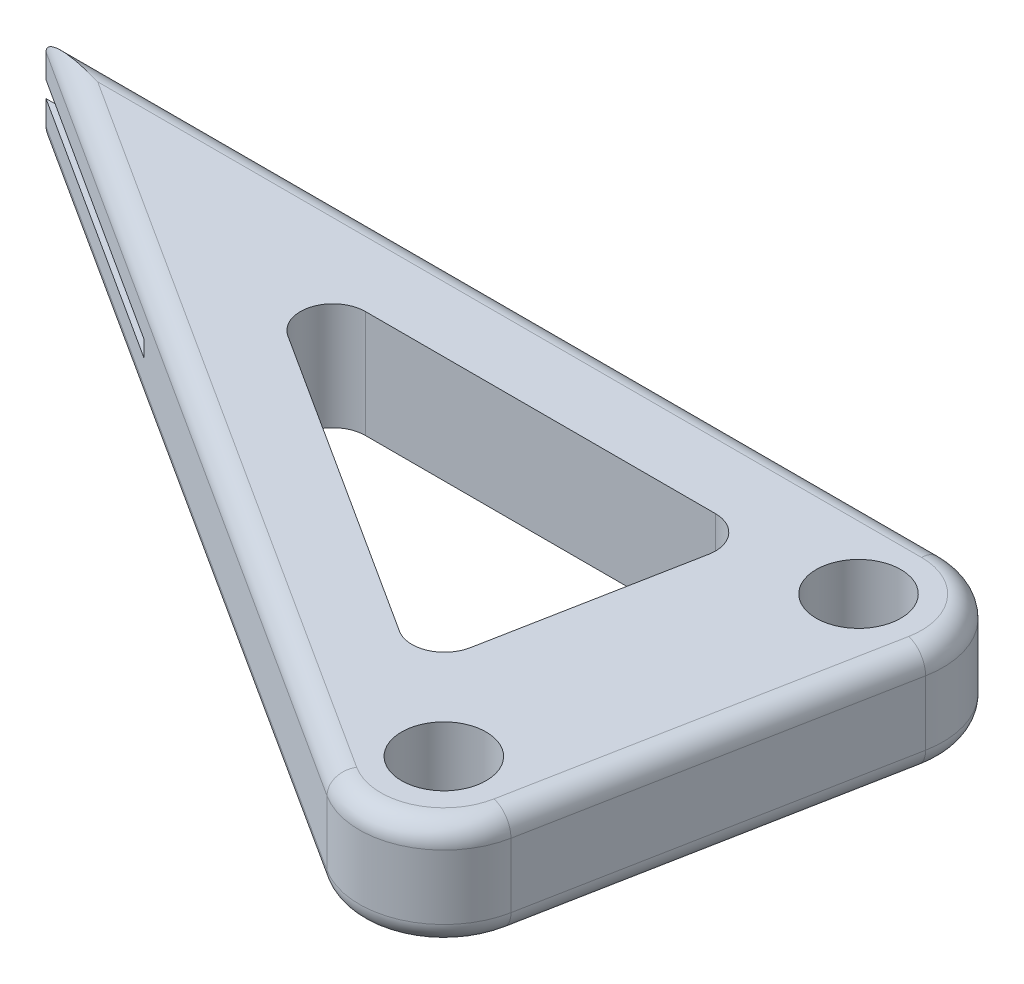
ISO-10303-21;
HEADER;
FILE_DESCRIPTION(('STEP AP214'),'2;1');
FILE_NAME('part.step','',(''),(''),'','','');
FILE_SCHEMA(('AUTOMOTIVE_DESIGN { 1 0 10303 214 1 1 1 1 }'));
ENDSEC;
DATA;
#1=APPLICATION_CONTEXT('core data for automotive mechanical design processes');
#2=APPLICATION_PROTOCOL_DEFINITION('international standard','automotive_design',2000,#1);
#3=PRODUCT_CONTEXT('',#1,'mechanical');
#4=PRODUCT('Part','Part','',(#3));
#5=PRODUCT_RELATED_PRODUCT_CATEGORY('part','',(#4));
#6=PRODUCT_DEFINITION_FORMATION('','',#4);
#7=PRODUCT_DEFINITION_CONTEXT('part definition',#1,'design');
#8=PRODUCT_DEFINITION('design','',#6,#7);
#9=PRODUCT_DEFINITION_SHAPE('','',#8);
#10=(LENGTH_UNIT() NAMED_UNIT(*) SI_UNIT(.MILLI.,.METRE.));
#11=(NAMED_UNIT(*) PLANE_ANGLE_UNIT() SI_UNIT($,.RADIAN.));
#12=(NAMED_UNIT(*) SI_UNIT($,.STERADIAN.) SOLID_ANGLE_UNIT());
#13=UNCERTAINTY_MEASURE_WITH_UNIT(LENGTH_MEASURE(1.E-05),#10,'distance_accuracy_value','');
#14=(GEOMETRIC_REPRESENTATION_CONTEXT(3) GLOBAL_UNCERTAINTY_ASSIGNED_CONTEXT((#13)) GLOBAL_UNIT_ASSIGNED_CONTEXT((#10,
#11,#12)) REPRESENTATION_CONTEXT('',''));
#15=CARTESIAN_POINT('',(0.,0.,0.));
#16=DIRECTION('',(0.,0.,1.));
#17=DIRECTION('',(1.,0.,0.));
#18=AXIS2_PLACEMENT_3D('',#15,#16,#17);
#19=CARTESIAN_POINT('',(-16.5593695843833,10.5409945852272,31.1982349996537));
#20=DIRECTION('',(0.,1.,0.));
#21=DIRECTION('',(0.,0.,1.));
#22=AXIS2_PLACEMENT_3D('',#19,#20,#21);
#23=PLANE('',#22);
#24=DIRECTION('',(-1.,0.,0.));
#25=VECTOR('',#24,1.);
#26=CARTESIAN_POINT('',(-19.3042202787324,10.5409945852272,4.18775475768354));
#27=LINE('',#26,#25);
#28=CARTESIAN_POINT('',(-22.3768257527279,10.5409945852272,4.18775475768354));
#29=VERTEX_POINT('',#28);
#30=CARTESIAN_POINT('',(-49.6901354335618,10.5409945852272,4.18775475768354));
#31=VERTEX_POINT('',#30);
#32=EDGE_CURVE('E236',#29,#31,#27,.T.);
#33=ORIENTED_EDGE('',*,*,#32,.F.);
#34=CARTESIAN_POINT('',(-22.3768257527279,10.5409945852272,6.72775475768354));
#35=DIRECTION('',(0.,1.,0.));
#36=DIRECTION('',(0.,0.,1.));
#37=AXIS2_PLACEMENT_3D('',#34,#35,#36);
#38=CIRCLE('',#37,2.54);
#39=CARTESIAN_POINT('',(-19.8821627369363,10.5409945852272,7.20551666244545));
#40=VERTEX_POINT('',#39);
#41=EDGE_CURVE('E358',#29,#40,#38,.F.);
#42=ORIENTED_EDGE('',*,*,#41,.T.);
#43=DIRECTION('',(0.188095238095238,0.,-0.982150793618727));
#44=VECTOR('',#43,1.);
#45=CARTESIAN_POINT('',(-23.5786182474099,10.5409945852272,26.506785264204));
#46=LINE('',#45,#44);
#47=CARTESIAN_POINT('',(-22.8722441318273,10.5409945852272,22.8184096028283));
#48=VERTEX_POINT('',#47);
#49=EDGE_CURVE('E229',#48,#40,#46,.T.);
#50=ORIENTED_EDGE('',*,*,#49,.F.);
#51=CARTESIAN_POINT('',(-25.3669071476189,10.5409945852272,22.3406476980664));
#52=DIRECTION('',(0.,1.,0.));
#53=DIRECTION('',(0.,0.,1.));
#54=AXIS2_PLACEMENT_3D('',#51,#52,#53);
#55=CIRCLE('',#54,2.54);
#56=CARTESIAN_POINT('',(-26.7389718063042,10.5409945852272,24.4781786504474));
#57=VERTEX_POINT('',#56);
#58=EDGE_CURVE('E354',#48,#57,#55,.F.);
#59=ORIENTED_EDGE('',*,*,#58,.T.);
#60=DIRECTION('',(0.841547619047619,0.,0.5401829364903));
#61=VECTOR('',#60,1.);
#62=CARTESIAN_POINT('',(-58.3492963148218,10.5409945852272,4.18775475768354));
#63=LINE('',#62,#61);
#64=CARTESIAN_POINT('',(-51.0622000922472,10.5409945852272,8.86528571006449));
#65=VERTEX_POINT('',#64);
#66=EDGE_CURVE('E238',#65,#57,#63,.T.);
#67=ORIENTED_EDGE('',*,*,#66,.F.);
#68=CARTESIAN_POINT('',(-49.6901354335618,10.5409945852272,6.72775475768354));
#69=DIRECTION('',(0.,1.,0.));
#70=DIRECTION('',(0.,0.,1.));
#71=AXIS2_PLACEMENT_3D('',#68,#69,#70);
#72=CIRCLE('',#71,2.54);
#73=EDGE_CURVE('E362',#65,#31,#72,.F.);
#74=ORIENTED_EDGE('',*,*,#73,.T.);
#75=EDGE_LOOP('',(#33,#42,#50,#59,#67,#74));
#76=FACE_BOUND('',#75,.T.);
#77=CARTESIAN_POINT('',(-11.3565424415261,10.5409945852272,4.03135475768354));
#78=DIRECTION('',(0.,1.,0.));
#79=DIRECTION('',(0.,0.,1.));
#80=AXIS2_PLACEMENT_3D('',#77,#78,#79);
#81=CIRCLE('',#80,4.9236);
#82=CARTESIAN_POINT('',(-6.52082479406497,10.5409945852272,4.95746047196925));
#83=VERTEX_POINT('',#82);
#84=CARTESIAN_POINT('',(-11.3565424415261,10.5409945852272,-0.892245242316461));
#85=VERTEX_POINT('',#84);
#86=EDGE_CURVE('E306',#83,#85,#81,.T.);
#87=ORIENTED_EDGE('',*,*,#86,.T.);
#88=DIRECTION('',(-1.,0.,0.));
#89=VECTOR('',#88,1.);
#90=CARTESIAN_POINT('',(-81.3826642589733,10.5409945852272,-0.892245242316454));
#91=LINE('',#90,#89);
#92=CARTESIAN_POINT('',(-75.6676180773418,10.5409945852272,-0.892245242316454));
#93=VERTEX_POINT('',#92);
#94=EDGE_CURVE('E308',#85,#93,#91,.T.);
#95=ORIENTED_EDGE('',*,*,#94,.T.);
#96=DIRECTION('',(0.841547619047619,0.,0.5401829364903));
#97=VECTOR('',#96,1.);
#98=CARTESIAN_POINT('',(-19.2190142904869,10.5409945852272,35.3416788567966));
#99=LINE('',#98,#97);
#100=CARTESIAN_POINT('',(-19.2190142904869,10.5409945852272,35.3416788567966));
#101=VERTEX_POINT('',#100);
#102=EDGE_CURVE('E300',#93,#101,#99,.T.);
#103=ORIENTED_EDGE('',*,*,#102,.T.);
#104=CARTESIAN_POINT('',(-16.5593695843833,10.5409945852272,31.1982349996537));
#105=DIRECTION('',(0.,1.,0.));
#106=DIRECTION('',(0.,0.,1.));
#107=AXIS2_PLACEMENT_3D('',#104,#105,#106);
#108=CIRCLE('',#107,4.9236);
#109=CARTESIAN_POINT('',(-11.7236519369221,10.5409945852272,32.1243407139394));
#110=VERTEX_POINT('',#109);
#111=EDGE_CURVE('E302',#101,#110,#108,.T.);
#112=ORIENTED_EDGE('',*,*,#111,.T.);
#113=DIRECTION('',(0.188095238095238,0.,-0.982150793618727));
#114=VECTOR('',#113,1.);
#115=CARTESIAN_POINT('',(-6.52082479406497,10.5409945852272,4.95746047196924));
#116=LINE('',#115,#114);
#117=EDGE_CURVE('E304',#110,#83,#116,.T.);
#118=ORIENTED_EDGE('',*,*,#117,.T.);
#119=EDGE_LOOP('',(#87,#95,#103,#112,#118));
#120=FACE_BOUND('',#119,.T.);
#121=CARTESIAN_POINT('',(-11.3565424415261,10.5409945852272,4.03135475768354));
#122=DIRECTION('',(0.,1.,0.));
#123=DIRECTION('',(0.,0.,1.));
#124=AXIS2_PLACEMENT_3D('',#121,#122,#123);
#125=CIRCLE('',#124,3.3);
#126=CARTESIAN_POINT('',(-11.3565424415261,10.5409945852272,7.33135475768354));
#127=VERTEX_POINT('',#126);
#128=EDGE_CURVE('E252',#127,#127,#125,.T.);
#129=ORIENTED_EDGE('',*,*,#128,.F.);
#130=EDGE_LOOP('',(#129));
#131=FACE_BOUND('',#130,.T.);
#132=CARTESIAN_POINT('',(-16.5593695843833,10.5409945852272,31.1982349996537));
#133=DIRECTION('',(0.,1.,0.));
#134=DIRECTION('',(0.,0.,1.));
#135=AXIS2_PLACEMENT_3D('',#132,#133,#134);
#136=CIRCLE('',#135,3.3);
#137=CARTESIAN_POINT('',(-16.5593695843833,10.5409945852272,34.4982349996537));
#138=VERTEX_POINT('',#137);
#139=EDGE_CURVE('E244',#138,#138,#136,.T.);
#140=ORIENTED_EDGE('',*,*,#139,.F.);
#141=EDGE_LOOP('',(#140));
#142=FACE_BOUND('',#141,.T.);
#143=ADVANCED_FACE('F34',(#76,#120,#131,#142),#23,.T.);
#144=CARTESIAN_POINT('',(-16.5593695843833,2.15899458522718,31.1982349996537));
#145=DIRECTION('',(0.,1.,0.));
#146=DIRECTION('',(0.,0.,1.));
#147=AXIS2_PLACEMENT_3D('',#144,#145,#146);
#148=PLANE('',#147);
#149=DIRECTION('',(0.841547619047619,0.,0.5401829364903));
#150=VECTOR('',#149,1.);
#151=CARTESIAN_POINT('',(-58.3492963148218,2.15899458522718,4.18775475768354));
#152=LINE('',#151,#150);
#153=CARTESIAN_POINT('',(-51.0622000922472,2.15899458522718,8.86528571006449));
#154=VERTEX_POINT('',#153);
#155=CARTESIAN_POINT('',(-26.7389718063042,2.15899458522718,24.4781786504474));
#156=VERTEX_POINT('',#155);
#157=EDGE_CURVE('E228',#154,#156,#152,.T.);
#158=ORIENTED_EDGE('',*,*,#157,.T.);
#159=CARTESIAN_POINT('',(-25.3669071476189,2.15899458522718,22.3406476980664));
#160=DIRECTION('',(0.,1.,0.));
#161=DIRECTION('',(0.,0.,1.));
#162=AXIS2_PLACEMENT_3D('',#159,#160,#161);
#163=CIRCLE('',#162,2.54);
#164=CARTESIAN_POINT('',(-22.8722441318273,2.15899458522718,22.8184096028283));
#165=VERTEX_POINT('',#164);
#166=EDGE_CURVE('E356',#156,#165,#163,.T.);
#167=ORIENTED_EDGE('',*,*,#166,.T.);
#168=DIRECTION('',(0.188095238095238,0.,-0.982150793618727));
#169=VECTOR('',#168,1.);
#170=CARTESIAN_POINT('',(-23.5786182474099,2.15899458522718,26.506785264204));
#171=LINE('',#170,#169);
#172=CARTESIAN_POINT('',(-19.8821627369363,2.15899458522718,7.20551666244545));
#173=VERTEX_POINT('',#172);
#174=EDGE_CURVE('E232',#165,#173,#171,.T.);
#175=ORIENTED_EDGE('',*,*,#174,.T.);
#176=CARTESIAN_POINT('',(-22.3768257527279,2.15899458522718,6.72775475768354));
#177=DIRECTION('',(0.,1.,0.));
#178=DIRECTION('',(0.,0.,1.));
#179=AXIS2_PLACEMENT_3D('',#176,#177,#178);
#180=CIRCLE('',#179,2.54);
#181=CARTESIAN_POINT('',(-22.3768257527279,2.15899458522718,4.18775475768354));
#182=VERTEX_POINT('',#181);
#183=EDGE_CURVE('E360',#173,#182,#180,.T.);
#184=ORIENTED_EDGE('',*,*,#183,.T.);
#185=DIRECTION('',(-1.,0.,0.));
#186=VECTOR('',#185,1.);
#187=CARTESIAN_POINT('',(-19.3042202787324,2.15899458522718,4.18775475768354));
#188=LINE('',#187,#186);
#189=CARTESIAN_POINT('',(-49.6901354335618,2.15899458522718,4.18775475768354));
#190=VERTEX_POINT('',#189);
#191=EDGE_CURVE('E226',#182,#190,#188,.T.);
#192=ORIENTED_EDGE('',*,*,#191,.T.);
#193=CARTESIAN_POINT('',(-49.6901354335618,2.15899458522718,6.72775475768354));
#194=DIRECTION('',(0.,1.,0.));
#195=DIRECTION('',(0.,0.,1.));
#196=AXIS2_PLACEMENT_3D('',#193,#194,#195);
#197=CIRCLE('',#196,2.54);
#198=EDGE_CURVE('E364',#190,#154,#197,.T.);
#199=ORIENTED_EDGE('',*,*,#198,.T.);
#200=EDGE_LOOP('',(#158,#167,#175,#184,#192,#199));
#201=FACE_BOUND('',#200,.T.);
#202=DIRECTION('',(0.841547619047619,0.,0.5401829364903));
#203=VECTOR('',#202,1.);
#204=CARTESIAN_POINT('',(-19.2190142904869,2.15899458522718,35.3416788567966));
#205=LINE('',#204,#203);
#206=CARTESIAN_POINT('',(-19.2190142904869,2.15899458522718,35.3416788567966));
#207=VERTEX_POINT('',#206);
#208=CARTESIAN_POINT('',(-75.6676180773418,2.15899458522718,-0.892245242316458));
#209=VERTEX_POINT('',#208);
#210=EDGE_CURVE('E277',#207,#209,#205,.F.);
#211=ORIENTED_EDGE('',*,*,#210,.T.);
#212=DIRECTION('',(-1.,0.,0.));
#213=VECTOR('',#212,1.);
#214=CARTESIAN_POINT('',(-16.5593695843833,2.15899458522718,-0.892245242316462));
#215=LINE('',#214,#213);
#216=CARTESIAN_POINT('',(-11.3565424415261,2.15899458522718,-0.892245242316461));
#217=VERTEX_POINT('',#216);
#218=EDGE_CURVE('E285',#209,#217,#215,.F.);
#219=ORIENTED_EDGE('',*,*,#218,.T.);
#220=CARTESIAN_POINT('',(-11.3565424415261,2.15899458522718,4.03135475768354));
#221=DIRECTION('',(0.,1.,0.));
#222=DIRECTION('',(0.,0.,1.));
#223=AXIS2_PLACEMENT_3D('',#220,#221,#222);
#224=CIRCLE('',#223,4.9236);
#225=CARTESIAN_POINT('',(-6.52082479406497,2.15899458522718,4.95746047196925));
#226=VERTEX_POINT('',#225);
#227=EDGE_CURVE('E283',#217,#226,#224,.F.);
#228=ORIENTED_EDGE('',*,*,#227,.T.);
#229=DIRECTION('',(0.188095238095238,0.,-0.982150793618727));
#230=VECTOR('',#229,1.);
#231=CARTESIAN_POINT('',(-11.7236519369221,2.15899458522718,32.1243407139394));
#232=LINE('',#231,#230);
#233=CARTESIAN_POINT('',(-11.7236519369221,2.15899458522718,32.1243407139394));
#234=VERTEX_POINT('',#233);
#235=EDGE_CURVE('E281',#226,#234,#232,.F.);
#236=ORIENTED_EDGE('',*,*,#235,.T.);
#237=CARTESIAN_POINT('',(-16.5593695843833,2.15899458522718,31.1982349996537));
#238=DIRECTION('',(0.,1.,0.));
#239=DIRECTION('',(0.,0.,1.));
#240=AXIS2_PLACEMENT_3D('',#237,#238,#239);
#241=CIRCLE('',#240,4.9236);
#242=EDGE_CURVE('E279',#234,#207,#241,.F.);
#243=ORIENTED_EDGE('',*,*,#242,.T.);
#244=EDGE_LOOP('',(#211,#219,#228,#236,#243));
#245=FACE_BOUND('',#244,.T.);
#246=CARTESIAN_POINT('',(-11.3565424415261,2.15899458522718,4.03135475768354));
#247=DIRECTION('',(0.,1.,0.));
#248=DIRECTION('',(0.,0.,1.));
#249=AXIS2_PLACEMENT_3D('',#246,#247,#248);
#250=CIRCLE('',#249,3.3);
#251=CARTESIAN_POINT('',(-11.3565424415261,2.15899458522718,7.33135475768354));
#252=VERTEX_POINT('',#251);
#253=EDGE_CURVE('E247',#252,#252,#250,.T.);
#254=ORIENTED_EDGE('',*,*,#253,.T.);
#255=EDGE_LOOP('',(#254));
#256=FACE_BOUND('',#255,.T.);
#257=CARTESIAN_POINT('',(-16.5593695843833,2.15899458522718,31.1982349996537));
#258=DIRECTION('',(0.,1.,0.));
#259=DIRECTION('',(0.,0.,1.));
#260=AXIS2_PLACEMENT_3D('',#257,#258,#259);
#261=CIRCLE('',#260,3.3);
#262=CARTESIAN_POINT('',(-16.5593695843833,2.15899458522718,34.4982349996537));
#263=VERTEX_POINT('',#262);
#264=EDGE_CURVE('E248',#263,#263,#261,.T.);
#265=ORIENTED_EDGE('',*,*,#264,.T.);
#266=EDGE_LOOP('',(#265));
#267=FACE_BOUND('',#266,.T.);
#268=ADVANCED_FACE('F433',(#201,#245,#256,#267),#148,.F.);
#269=CARTESIAN_POINT('',(-62.4476898223621,10.5409945852272,9.58556904339783));
#270=DIRECTION('',(0.5401829364903,0.,-0.841547619047619));
#271=DIRECTION('',(-0.841547619047619,0.,-0.5401829364903));
#272=AXIS2_PLACEMENT_3D('',#269,#270,#271);
#273=PLANE('',#272);
#274=DIRECTION('',(0.,1.,0.));
#275=VECTOR('',#274,1.);
#276=CARTESIAN_POINT('',(-60.0073547351639,6.98499458522718,11.1520013445372));
#277=LINE('',#276,#275);
#278=CARTESIAN_POINT('',(-60.0073547351639,5.71499458522717,11.1520013445372));
#279=VERTEX_POINT('',#278);
#280=CARTESIAN_POINT('',(-60.0073547351639,6.98499458522718,11.1520013445372));
#281=VERTEX_POINT('',#280);
#282=EDGE_CURVE('E204',#279,#281,#277,.T.);
#283=ORIENTED_EDGE('',*,*,#282,.F.);
#284=DIRECTION('',(-0.841547619047619,0.,-0.5401829364903));
#285=VECTOR('',#284,1.);
#286=CARTESIAN_POINT('',(-60.0073547351639,5.71499458522717,11.1520013445372));
#287=LINE('',#286,#285);
#288=CARTESIAN_POINT('',(-81.3826642589734,5.71499458522717,-2.56864524231647));
#289=VERTEX_POINT('',#288);
#290=EDGE_CURVE('E239',#279,#289,#287,.T.);
#291=ORIENTED_EDGE('',*,*,#290,.T.);
#292=DIRECTION('',(0.,-1.,0.));
#293=VECTOR('',#292,1.);
#294=CARTESIAN_POINT('',(-81.3826642589733,10.5409945852272,-2.56864524231646));
#295=LINE('',#294,#293);
#296=CARTESIAN_POINT('',(-81.3826642589733,3.83539458522718,-2.56864524231646));
#297=VERTEX_POINT('',#296);
#298=EDGE_CURVE('E255',#289,#297,#295,.T.);
#299=ORIENTED_EDGE('',*,*,#298,.T.);
#300=DIRECTION('',(0.841547619047619,0.,0.5401829364903));
#301=VECTOR('',#300,1.);
#302=CARTESIAN_POINT('',(-62.4476898223621,3.83539458522718,9.58556904339783));
#303=LINE('',#302,#301);
#304=CARTESIAN_POINT('',(-20.1245769652193,3.83539458522718,36.752449285368));
#305=VERTEX_POINT('',#304);
#306=EDGE_CURVE('E313',#297,#305,#303,.T.);
#307=ORIENTED_EDGE('',*,*,#306,.T.);
#308=DIRECTION('',(0.,-1.,0.));
#309=VECTOR('',#308,1.);
#310=CARTESIAN_POINT('',(-20.1245769652193,10.5409945852272,36.752449285368));
#311=LINE('',#310,#309);
#312=CARTESIAN_POINT('',(-20.1245769652193,8.86459458522718,36.752449285368));
#313=VERTEX_POINT('',#312);
#314=EDGE_CURVE('E268',#313,#305,#311,.T.);
#315=ORIENTED_EDGE('',*,*,#314,.F.);
#316=DIRECTION('',(0.841547619047619,0.,0.5401829364903));
#317=VECTOR('',#316,1.);
#318=CARTESIAN_POINT('',(-81.3826642589734,8.86459458522718,-2.56864524231646));
#319=LINE('',#318,#317);
#320=CARTESIAN_POINT('',(-81.3826642589733,8.86459458522718,-2.56864524231646));
#321=VERTEX_POINT('',#320);
#322=EDGE_CURVE('E311',#313,#321,#319,.F.);
#323=ORIENTED_EDGE('',*,*,#322,.T.);
#324=CARTESIAN_POINT('',(-81.3826642589733,6.98499458522718,-2.56864524231646));
#325=VERTEX_POINT('',#324);
#326=EDGE_CURVE('E218',#321,#325,#295,.T.);
#327=ORIENTED_EDGE('',*,*,#326,.T.);
#328=DIRECTION('',(-0.841547619047619,0.,-0.5401829364903));
#329=VECTOR('',#328,1.);
#330=CARTESIAN_POINT('',(-60.0073547351639,6.98499458522718,11.1520013445372));
#331=LINE('',#330,#329);
#332=EDGE_CURVE('E49',#281,#325,#331,.T.);
#333=ORIENTED_EDGE('',*,*,#332,.F.);
#334=EDGE_LOOP('',(#283,#291,#299,#307,#315,#323,#327,#333));
#335=FACE_BOUND('',#334,.T.);
#336=ADVANCED_FACE('F216',(#335),#273,.F.);
#337=CARTESIAN_POINT('',(-16.5593695843833,10.5409945852272,31.1982349996537));
#338=DIRECTION('',(0.,-1.,0.));
#339=DIRECTION('',(0.,0.,-1.));
#340=AXIS2_PLACEMENT_3D('',#337,#338,#339);
#341=CYLINDRICAL_SURFACE('',#340,6.6);
#342=ORIENTED_EDGE('',*,*,#314,.T.);
#343=CARTESIAN_POINT('',(-16.5593695843833,3.83539458522718,31.1982349996537));
#344=DIRECTION('',(0.,1.,0.));
#345=DIRECTION('',(0.,0.,1.));
#346=AXIS2_PLACEMENT_3D('',#343,#344,#345);
#347=CIRCLE('',#346,6.6);
#348=CARTESIAN_POINT('',(-10.0771743464997,3.83539458522718,32.4396635710823));
#349=VERTEX_POINT('',#348);
#350=EDGE_CURVE('E298',#305,#349,#347,.T.);
#351=ORIENTED_EDGE('',*,*,#350,.T.);
#352=DIRECTION('',(0.,-1.,0.));
#353=VECTOR('',#352,1.);
#354=CARTESIAN_POINT('',(-10.0771743464997,10.5409945852272,32.4396635710823));
#355=LINE('',#354,#353);
#356=CARTESIAN_POINT('',(-10.0771743464997,8.86459458522718,32.4396635710823));
#357=VERTEX_POINT('',#356);
#358=EDGE_CURVE('E265',#357,#349,#355,.T.);
#359=ORIENTED_EDGE('',*,*,#358,.F.);
#360=CARTESIAN_POINT('',(-16.5593695843833,8.86459458522718,31.1982349996537));
#361=DIRECTION('',(0.,1.,0.));
#362=DIRECTION('',(0.,0.,1.));
#363=AXIS2_PLACEMENT_3D('',#360,#361,#362);
#364=CIRCLE('',#363,6.6);
#365=EDGE_CURVE('E296',#357,#313,#364,.F.);
#366=ORIENTED_EDGE('',*,*,#365,.T.);
#367=EDGE_LOOP('',(#342,#351,#359,#366));
#368=FACE_BOUND('',#367,.T.);
#369=ADVANCED_FACE('F456',(#368),#341,.T.);
#370=CARTESIAN_POINT('',(-10.0771743464997,10.5409945852272,32.4396635710823));
#371=DIRECTION('',(-0.982150793618727,0.,-0.188095238095238));
#372=DIRECTION('',(-0.188095238095238,0.,0.982150793618727));
#373=AXIS2_PLACEMENT_3D('',#370,#371,#372);
#374=PLANE('',#373);
#375=ORIENTED_EDGE('',*,*,#358,.T.);
#376=DIRECTION('',(0.188095238095238,0.,-0.982150793618727));
#377=VECTOR('',#376,1.);
#378=CARTESIAN_POINT('',(-10.0771743464997,3.83539458522718,32.4396635710823));
#379=LINE('',#378,#377);
#380=CARTESIAN_POINT('',(-4.87434720364254,3.83539458522718,5.27278332911211));
#381=VERTEX_POINT('',#380);
#382=EDGE_CURVE('E294',#349,#381,#379,.T.);
#383=ORIENTED_EDGE('',*,*,#382,.T.);
#384=DIRECTION('',(0.,-1.,0.));
#385=VECTOR('',#384,1.);
#386=CARTESIAN_POINT('',(-4.87434720364254,10.5409945852272,5.27278332911211));
#387=LINE('',#386,#385);
#388=CARTESIAN_POINT('',(-4.87434720364254,8.86459458522718,5.27278332911211));
#389=VERTEX_POINT('',#388);
#390=EDGE_CURVE('E262',#389,#381,#387,.T.);
#391=ORIENTED_EDGE('',*,*,#390,.F.);
#392=DIRECTION('',(0.188095238095238,0.,-0.982150793618727));
#393=VECTOR('',#392,1.);
#394=CARTESIAN_POINT('',(-10.0771743464997,8.86459458522718,32.4396635710823));
#395=LINE('',#394,#393);
#396=EDGE_CURVE('E292',#389,#357,#395,.F.);
#397=ORIENTED_EDGE('',*,*,#396,.T.);
#398=EDGE_LOOP('',(#375,#383,#391,#397));
#399=FACE_BOUND('',#398,.T.);
#400=ADVANCED_FACE('F452',(#399),#374,.F.);
#401=CARTESIAN_POINT('',(-11.3565424415261,10.5409945852272,4.03135475768354));
#402=DIRECTION('',(0.,-1.,0.));
#403=DIRECTION('',(0.,0.,-1.));
#404=AXIS2_PLACEMENT_3D('',#401,#402,#403);
#405=CYLINDRICAL_SURFACE('',#404,6.6);
#406=ORIENTED_EDGE('',*,*,#390,.T.);
#407=CARTESIAN_POINT('',(-11.3565424415261,3.83539458522718,4.03135475768354));
#408=DIRECTION('',(0.,1.,0.));
#409=DIRECTION('',(0.,0.,1.));
#410=AXIS2_PLACEMENT_3D('',#407,#408,#409);
#411=CIRCLE('',#410,6.6);
#412=CARTESIAN_POINT('',(-11.3565424415261,3.83539458522718,-2.56864524231646));
#413=VERTEX_POINT('',#412);
#414=EDGE_CURVE('E290',#381,#413,#411,.T.);
#415=ORIENTED_EDGE('',*,*,#414,.T.);
#416=DIRECTION('',(0.,-1.,0.));
#417=VECTOR('',#416,1.);
#418=CARTESIAN_POINT('',(-11.3565424415261,10.5409945852272,-2.56864524231646));
#419=LINE('',#418,#417);
#420=CARTESIAN_POINT('',(-11.3565424415261,8.86459458522718,-2.56864524231646));
#421=VERTEX_POINT('',#420);
#422=EDGE_CURVE('E259',#421,#413,#419,.T.);
#423=ORIENTED_EDGE('',*,*,#422,.F.);
#424=CARTESIAN_POINT('',(-11.3565424415261,8.86459458522718,4.03135475768354));
#425=DIRECTION('',(0.,1.,0.));
#426=DIRECTION('',(0.,0.,1.));
#427=AXIS2_PLACEMENT_3D('',#424,#425,#426);
#428=CIRCLE('',#427,6.6);
#429=EDGE_CURVE('E288',#421,#389,#428,.F.);
#430=ORIENTED_EDGE('',*,*,#429,.T.);
#431=EDGE_LOOP('',(#406,#415,#423,#430));
#432=FACE_BOUND('',#431,.T.);
#433=ADVANCED_FACE('F449',(#432),#405,.T.);
#434=CARTESIAN_POINT('',(-58.8824824415261,10.5409945852272,-2.56864524231646));
#435=DIRECTION('',(0.,0.,1.));
#436=DIRECTION('',(1.,0.,0.));
#437=AXIS2_PLACEMENT_3D('',#434,#435,#436);
#438=PLANE('',#437);
#439=ORIENTED_EDGE('',*,*,#298,.F.);
#440=DIRECTION('',(1.,0.,0.));
#441=VECTOR('',#440,1.);
#442=CARTESIAN_POINT('',(-58.8824824415261,5.71499458522718,-2.56864524231646));
#443=LINE('',#442,#441);
#444=CARTESIAN_POINT('',(-77.8560811862513,5.71499458522717,-2.56864524231646));
#445=VERTEX_POINT('',#444);
#446=EDGE_CURVE('E11',#289,#445,#443,.T.);
#447=ORIENTED_EDGE('',*,*,#446,.T.);
#448=DIRECTION('',(0.,-1.,0.));
#449=VECTOR('',#448,1.);
#450=CARTESIAN_POINT('',(-77.8560811862513,10.5409945852272,-2.56864524231646));
#451=LINE('',#450,#449);
#452=CARTESIAN_POINT('',(-77.8560811862513,5.07999458522718,-2.56864524231646));
#453=VERTEX_POINT('',#452);
#454=EDGE_CURVE('E42',#445,#453,#451,.T.);
#455=ORIENTED_EDGE('',*,*,#454,.T.);
#456=DIRECTION('',(1.,0.,0.));
#457=VECTOR('',#456,1.);
#458=CARTESIAN_POINT('',(-58.8824824415261,5.07999458522717,-2.56864524231646));
#459=LINE('',#458,#457);
#460=CARTESIAN_POINT('',(-75.5050258044366,5.07999458522718,-2.56864524231646));
#461=VERTEX_POINT('',#460);
#462=EDGE_CURVE('E377',#453,#461,#459,.T.);
#463=ORIENTED_EDGE('',*,*,#462,.T.);
#464=DIRECTION('',(0.,1.,0.));
#465=VECTOR('',#464,1.);
#466=CARTESIAN_POINT('',(-75.5050258044366,10.5409945852272,-2.56864524231646));
#467=LINE('',#466,#465);
#468=CARTESIAN_POINT('',(-75.5050258044366,7.61999458522718,-2.56864524231646));
#469=VERTEX_POINT('',#468);
#470=EDGE_CURVE('E374',#461,#469,#467,.T.);
#471=ORIENTED_EDGE('',*,*,#470,.T.);
#472=DIRECTION('',(-1.,0.,0.));
#473=VECTOR('',#472,1.);
#474=CARTESIAN_POINT('',(-58.8824824415261,7.61999458522718,-2.56864524231646));
#475=LINE('',#474,#473);
#476=CARTESIAN_POINT('',(-77.8560811862513,7.61999458522718,-2.56864524231646));
#477=VERTEX_POINT('',#476);
#478=EDGE_CURVE('E371',#469,#477,#475,.T.);
#479=ORIENTED_EDGE('',*,*,#478,.T.);
#480=DIRECTION('',(0.,-1.,0.));
#481=VECTOR('',#480,1.);
#482=CARTESIAN_POINT('',(-77.8560811862513,10.5409945852272,-2.56864524231646));
#483=LINE('',#482,#481);
#484=CARTESIAN_POINT('',(-77.8560811862513,6.98499458522718,-2.56864524231646));
#485=VERTEX_POINT('',#484);
#486=EDGE_CURVE('E368',#477,#485,#483,.T.);
#487=ORIENTED_EDGE('',*,*,#486,.T.);
#488=DIRECTION('',(-1.,0.,0.));
#489=VECTOR('',#488,1.);
#490=CARTESIAN_POINT('',(-58.8824824415261,6.98499458522717,-2.56864524231646));
#491=LINE('',#490,#489);
#492=EDGE_CURVE('E366',#485,#325,#491,.T.);
#493=ORIENTED_EDGE('',*,*,#492,.T.);
#494=ORIENTED_EDGE('',*,*,#326,.F.);
#495=DIRECTION('',(-1.,0.,0.));
#496=VECTOR('',#495,1.);
#497=CARTESIAN_POINT('',(-11.3565424415261,8.86459458522718,-2.56864524231646));
#498=LINE('',#497,#496);
#499=EDGE_CURVE('E271',#321,#421,#498,.F.);
#500=ORIENTED_EDGE('',*,*,#499,.T.);
#501=ORIENTED_EDGE('',*,*,#422,.T.);
#502=DIRECTION('',(-1.,0.,0.));
#503=VECTOR('',#502,1.);
#504=CARTESIAN_POINT('',(-58.8824824415261,3.83539458522718,-2.56864524231646));
#505=LINE('',#504,#503);
#506=EDGE_CURVE('E274',#413,#297,#505,.T.);
#507=ORIENTED_EDGE('',*,*,#506,.T.);
#508=EDGE_LOOP('',(#439,#447,#455,#463,#471,#479,#487,#493,#494,#500,#501,#507));
#509=FACE_BOUND('',#508,.T.);
#510=ADVANCED_FACE('F382',(#509),#438,.F.);
#511=CARTESIAN_POINT('',(-11.3565424415261,10.5409945852272,4.03135475768354));
#512=DIRECTION('',(0.,-1.,0.));
#513=DIRECTION('',(0.,0.,-1.));
#514=AXIS2_PLACEMENT_3D('',#511,#512,#513);
#515=CYLINDRICAL_SURFACE('',#514,3.3);
#516=ORIENTED_EDGE('',*,*,#128,.T.);
#517=EDGE_LOOP('',(#516));
#518=FACE_BOUND('',#517,.T.);
#519=ORIENTED_EDGE('',*,*,#253,.F.);
#520=EDGE_LOOP('',(#519));
#521=FACE_BOUND('',#520,.T.);
#522=ADVANCED_FACE('F444',(#518,#521),#515,.F.);
#523=CARTESIAN_POINT('',(-16.5593695843833,10.5409945852272,31.1982349996537));
#524=DIRECTION('',(0.,-1.,0.));
#525=DIRECTION('',(0.,0.,-1.));
#526=AXIS2_PLACEMENT_3D('',#523,#524,#525);
#527=CYLINDRICAL_SURFACE('',#526,3.3);
#528=ORIENTED_EDGE('',*,*,#139,.T.);
#529=EDGE_LOOP('',(#528));
#530=FACE_BOUND('',#529,.T.);
#531=ORIENTED_EDGE('',*,*,#264,.F.);
#532=EDGE_LOOP('',(#531));
#533=FACE_BOUND('',#532,.T.);
#534=ADVANCED_FACE('F483',(#530,#533),#527,.F.);
#535=CARTESIAN_POINT('',(-11.7236519369221,3.83539458522718,32.1243407139394));
#536=DIRECTION('',(0.188095238095238,0.,-0.982150793618727));
#537=DIRECTION('',(-0.982150793618727,0.,-0.188095238095238));
#538=AXIS2_PLACEMENT_3D('',#535,#536,#537);
#539=CYLINDRICAL_SURFACE('',#538,1.6764);
#540=CARTESIAN_POINT('',(-6.52082479406497,3.83539458522718,4.95746047196925));
#541=DIRECTION('',(0.188095238095238,0.,-0.982150793618727));
#542=DIRECTION('',(-0.982150793618727,0.,-0.188095238095238));
#543=AXIS2_PLACEMENT_3D('',#540,#541,#542);
#544=CIRCLE('',#543,1.6764);
#545=EDGE_CURVE('E325',#381,#226,#544,.T.);
#546=ORIENTED_EDGE('',*,*,#545,.F.);
#547=ORIENTED_EDGE('',*,*,#382,.F.);
#548=CARTESIAN_POINT('',(-11.7236519369221,3.83539458522718,32.1243407139394));
#549=DIRECTION('',(-0.188095238095238,0.,0.982150793618727));
#550=DIRECTION('',(0.982150793618727,0.,0.188095238095238));
#551=AXIS2_PLACEMENT_3D('',#548,#549,#550);
#552=CIRCLE('',#551,1.6764);
#553=EDGE_CURVE('E251',#234,#349,#552,.T.);
#554=ORIENTED_EDGE('',*,*,#553,.F.);
#555=ORIENTED_EDGE('',*,*,#235,.F.);
#556=EDGE_LOOP('',(#546,#547,#554,#555));
#557=FACE_BOUND('',#556,.T.);
#558=ADVANCED_FACE('F479',(#557),#539,.T.);
#559=CARTESIAN_POINT('',(-16.5593695843833,3.83539458522718,31.1982349996537));
#560=DIRECTION('',(0.,1.,0.));
#561=DIRECTION('',(0.,0.,1.));
#562=AXIS2_PLACEMENT_3D('',#559,#560,#561);
#563=TOROIDAL_SURFACE('',#562,4.9236,1.6764);
#564=ORIENTED_EDGE('',*,*,#553,.T.);
#565=ORIENTED_EDGE('',*,*,#350,.F.);
#566=CARTESIAN_POINT('',(-19.2190142904869,3.83539458522718,35.3416788567966));
#567=DIRECTION('',(-0.841547619047619,0.,-0.5401829364903));
#568=DIRECTION('',(-0.5401829364903,0.,0.841547619047619));
#569=AXIS2_PLACEMENT_3D('',#566,#567,#568);
#570=CIRCLE('',#569,1.6764);
#571=EDGE_CURVE('E322',#207,#305,#570,.T.);
#572=ORIENTED_EDGE('',*,*,#571,.F.);
#573=ORIENTED_EDGE('',*,*,#242,.F.);
#574=EDGE_LOOP('',(#564,#565,#572,#573));
#575=FACE_BOUND('',#574,.T.);
#576=ADVANCED_FACE('F475',(#575),#563,.T.);
#577=CARTESIAN_POINT('',(-11.3565424415261,3.83539458522718,4.03135475768354));
#578=DIRECTION('',(0.,1.,0.));
#579=DIRECTION('',(0.,0.,1.));
#580=AXIS2_PLACEMENT_3D('',#577,#578,#579);
#581=TOROIDAL_SURFACE('',#580,4.9236,1.6764);
#582=ORIENTED_EDGE('',*,*,#545,.T.);
#583=ORIENTED_EDGE('',*,*,#227,.F.);
#584=CARTESIAN_POINT('',(-11.3565424415261,3.83539458522718,-0.892245242316461));
#585=DIRECTION('',(-1.,0.,0.));
#586=DIRECTION('',(0.,-1.,0.));
#587=AXIS2_PLACEMENT_3D('',#584,#585,#586);
#588=CIRCLE('',#587,1.6764);
#589=EDGE_CURVE('E319',#413,#217,#588,.T.);
#590=ORIENTED_EDGE('',*,*,#589,.F.);
#591=ORIENTED_EDGE('',*,*,#414,.F.);
#592=EDGE_LOOP('',(#582,#583,#590,#591));
#593=FACE_BOUND('',#592,.T.);
#594=ADVANCED_FACE('F471',(#593),#581,.T.);
#595=CARTESIAN_POINT('',(-61.5421271476298,3.83539458522718,8.17479861482641));
#596=DIRECTION('',(0.841547619047619,0.,0.5401829364903));
#597=DIRECTION('',(0.5401829364903,0.,-0.841547619047619));
#598=AXIS2_PLACEMENT_3D('',#595,#596,#597);
#599=CYLINDRICAL_SURFACE('',#598,1.6764);
#600=ORIENTED_EDGE('',*,*,#571,.T.);
#601=ORIENTED_EDGE('',*,*,#306,.F.);
#602=CARTESIAN_POINT('',(-75.6676180773418,3.83539458522718,-0.89224524231646));
#603=DIRECTION('',(-0.281471473645537,0.,0.959569595977181));
#604=DIRECTION('',(0.959569595977181,0.,0.281471473645537));
#605=AXIS2_PLACEMENT_3D('',#602,#603,#604);
#606=ELLIPSE('',#605,5.95584333391854,1.6764);
#607=EDGE_CURVE('E316',#209,#297,#606,.F.);
#608=ORIENTED_EDGE('',*,*,#607,.F.);
#609=ORIENTED_EDGE('',*,*,#210,.F.);
#610=EDGE_LOOP('',(#600,#601,#608,#609));
#611=FACE_BOUND('',#610,.T.);
#612=ADVANCED_FACE('F467',(#611),#599,.T.);
#613=CARTESIAN_POINT('',(-58.8824824415261,3.83539458522718,-0.89224524231646));
#614=DIRECTION('',(-1.,0.,0.));
#615=DIRECTION('',(0.,0.,1.));
#616=AXIS2_PLACEMENT_3D('',#613,#614,#615);
#617=CYLINDRICAL_SURFACE('',#616,1.6764);
#618=ORIENTED_EDGE('',*,*,#589,.T.);
#619=ORIENTED_EDGE('',*,*,#218,.F.);
#620=ORIENTED_EDGE('',*,*,#607,.T.);
#621=ORIENTED_EDGE('',*,*,#506,.F.);
#622=EDGE_LOOP('',(#618,#619,#620,#621));
#623=FACE_BOUND('',#622,.T.);
#624=ADVANCED_FACE('F463',(#623),#617,.T.);
#625=CARTESIAN_POINT('',(-11.7236519369221,8.86459458522718,32.1243407139394));
#626=DIRECTION('',(-0.188095238095238,0.,0.982150793618727));
#627=DIRECTION('',(0.982150793618727,0.,0.188095238095238));
#628=AXIS2_PLACEMENT_3D('',#625,#626,#627);
#629=CYLINDRICAL_SURFACE('',#628,1.6764);
#630=CARTESIAN_POINT('',(-6.52082479406497,8.86459458522718,4.95746047196925));
#631=DIRECTION('',(0.188095238095238,0.,-0.982150793618727));
#632=DIRECTION('',(-0.982150793618727,0.,-0.188095238095238));
#633=AXIS2_PLACEMENT_3D('',#630,#631,#632);
#634=CIRCLE('',#633,1.6764);
#635=EDGE_CURVE('E336',#83,#389,#634,.T.);
#636=ORIENTED_EDGE('',*,*,#635,.F.);
#637=ORIENTED_EDGE('',*,*,#117,.F.);
#638=CARTESIAN_POINT('',(-11.7236519369221,8.86459458522718,32.1243407139394));
#639=DIRECTION('',(-0.188095238095238,0.,0.982150793618727));
#640=DIRECTION('',(0.982150793618727,0.,0.188095238095238));
#641=AXIS2_PLACEMENT_3D('',#638,#639,#640);
#642=CIRCLE('',#641,1.6764);
#643=EDGE_CURVE('E320',#357,#110,#642,.T.);
#644=ORIENTED_EDGE('',*,*,#643,.F.);
#645=ORIENTED_EDGE('',*,*,#396,.F.);
#646=EDGE_LOOP('',(#636,#637,#644,#645));
#647=FACE_BOUND('',#646,.T.);
#648=ADVANCED_FACE('F466',(#647),#629,.T.);
#649=CARTESIAN_POINT('',(-16.5593695843833,8.86459458522718,31.1982349996537));
#650=DIRECTION('',(0.,1.,0.));
#651=DIRECTION('',(0.,0.,1.));
#652=AXIS2_PLACEMENT_3D('',#649,#650,#651);
#653=TOROIDAL_SURFACE('',#652,4.9236,1.6764);
#654=ORIENTED_EDGE('',*,*,#643,.T.);
#655=ORIENTED_EDGE('',*,*,#111,.F.);
#656=CARTESIAN_POINT('',(-19.2190142904869,8.86459458522718,35.3416788567966));
#657=DIRECTION('',(-0.841547619047619,0.,-0.5401829364903));
#658=DIRECTION('',(-0.5401829364903,0.,0.841547619047619));
#659=AXIS2_PLACEMENT_3D('',#656,#657,#658);
#660=CIRCLE('',#659,1.6764);
#661=EDGE_CURVE('E333',#313,#101,#660,.T.);
#662=ORIENTED_EDGE('',*,*,#661,.F.);
#663=ORIENTED_EDGE('',*,*,#365,.F.);
#664=EDGE_LOOP('',(#654,#655,#662,#663));
#665=FACE_BOUND('',#664,.T.);
#666=ADVANCED_FACE('F497',(#665),#653,.T.);
#667=CARTESIAN_POINT('',(-11.3565424415261,8.86459458522718,4.03135475768354));
#668=DIRECTION('',(0.,1.,0.));
#669=DIRECTION('',(0.,0.,1.));
#670=AXIS2_PLACEMENT_3D('',#667,#668,#669);
#671=TOROIDAL_SURFACE('',#670,4.9236,1.6764);
#672=ORIENTED_EDGE('',*,*,#635,.T.);
#673=ORIENTED_EDGE('',*,*,#429,.F.);
#674=CARTESIAN_POINT('',(-11.3565424415261,8.86459458522718,-0.892245242316461));
#675=DIRECTION('',(-1.,0.,0.));
#676=DIRECTION('',(0.,0.,1.));
#677=AXIS2_PLACEMENT_3D('',#674,#675,#676);
#678=CIRCLE('',#677,1.6764);
#679=EDGE_CURVE('E331',#85,#421,#678,.T.);
#680=ORIENTED_EDGE('',*,*,#679,.F.);
#681=ORIENTED_EDGE('',*,*,#86,.F.);
#682=EDGE_LOOP('',(#672,#673,#680,#681));
#683=FACE_BOUND('',#682,.T.);
#684=ADVANCED_FACE('F493',(#683),#671,.T.);
#685=CARTESIAN_POINT('',(-19.2190142904869,8.86459458522718,35.3416788567966));
#686=DIRECTION('',(-0.841547619047619,0.,-0.5401829364903));
#687=DIRECTION('',(-0.5401829364903,0.,0.841547619047619));
#688=AXIS2_PLACEMENT_3D('',#685,#686,#687);
#689=CYLINDRICAL_SURFACE('',#688,1.6764);
#690=ORIENTED_EDGE('',*,*,#661,.T.);
#691=ORIENTED_EDGE('',*,*,#102,.F.);
#692=CARTESIAN_POINT('',(-75.6676180773418,8.86459458522718,-0.892245242316458));
#693=DIRECTION('',(0.281471473645537,0.,-0.959569595977181));
#694=DIRECTION('',(-0.959569595977181,0.,-0.281471473645537));
#695=AXIS2_PLACEMENT_3D('',#692,#693,#694);
#696=ELLIPSE('',#695,5.95584333391854,1.6764);
#697=EDGE_CURVE('E235',#321,#93,#696,.T.);
#698=ORIENTED_EDGE('',*,*,#697,.F.);
#699=ORIENTED_EDGE('',*,*,#322,.F.);
#700=EDGE_LOOP('',(#690,#691,#698,#699));
#701=FACE_BOUND('',#700,.T.);
#702=ADVANCED_FACE('F489',(#701),#689,.T.);
#703=CARTESIAN_POINT('',(-16.5593695843833,8.86459458522718,-0.892245242316457));
#704=DIRECTION('',(1.,0.,0.));
#705=DIRECTION('',(0.,0.,-1.));
#706=AXIS2_PLACEMENT_3D('',#703,#704,#705);
#707=CYLINDRICAL_SURFACE('',#706,1.6764);
#708=ORIENTED_EDGE('',*,*,#679,.T.);
#709=ORIENTED_EDGE('',*,*,#499,.F.);
#710=ORIENTED_EDGE('',*,*,#697,.T.);
#711=ORIENTED_EDGE('',*,*,#94,.F.);
#712=EDGE_LOOP('',(#708,#709,#710,#711));
#713=FACE_BOUND('',#712,.T.);
#714=ADVANCED_FACE('F485',(#713),#707,.T.);
#715=CARTESIAN_POINT('',(-19.3042202787324,2.15899458522718,4.18775475768354));
#716=DIRECTION('',(0.,0.,-1.));
#717=DIRECTION('',(-1.,0.,0.));
#718=AXIS2_PLACEMENT_3D('',#715,#716,#717);
#719=PLANE('',#718);
#720=ORIENTED_EDGE('',*,*,#191,.F.);
#721=DIRECTION('',(0.,1.,0.));
#722=VECTOR('',#721,1.);
#723=CARTESIAN_POINT('',(-22.3768257527279,10.5409945852272,4.18775475768354));
#724=LINE('',#723,#722);
#725=EDGE_CURVE('E351',#182,#29,#724,.T.);
#726=ORIENTED_EDGE('',*,*,#725,.T.);
#727=ORIENTED_EDGE('',*,*,#32,.T.);
#728=DIRECTION('',(0.,1.,0.));
#729=VECTOR('',#728,1.);
#730=CARTESIAN_POINT('',(-49.6901354335618,2.15899458522718,4.18775475768354));
#731=LINE('',#730,#729);
#732=EDGE_CURVE('E57',#31,#190,#731,.F.);
#733=ORIENTED_EDGE('',*,*,#732,.T.);
#734=EDGE_LOOP('',(#720,#726,#727,#733));
#735=FACE_BOUND('',#734,.T.);
#736=ADVANCED_FACE('F488',(#735),#719,.F.);
#737=CARTESIAN_POINT('',(-23.5786182474099,2.15899458522718,26.506785264204));
#738=DIRECTION('',(0.982150793618727,0.,0.188095238095238));
#739=DIRECTION('',(0.188095238095238,0.,-0.982150793618727));
#740=AXIS2_PLACEMENT_3D('',#737,#738,#739);
#741=PLANE('',#740);
#742=ORIENTED_EDGE('',*,*,#174,.F.);
#743=DIRECTION('',(0.,1.,0.));
#744=VECTOR('',#743,1.);
#745=CARTESIAN_POINT('',(-22.8722441318273,10.5409945852272,22.8184096028283));
#746=LINE('',#745,#744);
#747=EDGE_CURVE('E342',#165,#48,#746,.T.);
#748=ORIENTED_EDGE('',*,*,#747,.T.);
#749=ORIENTED_EDGE('',*,*,#49,.T.);
#750=DIRECTION('',(0.,1.,0.));
#751=VECTOR('',#750,1.);
#752=CARTESIAN_POINT('',(-19.8821627369363,2.15899458522718,7.20551666244545));
#753=LINE('',#752,#751);
#754=EDGE_CURVE('E315',#40,#173,#753,.F.);
#755=ORIENTED_EDGE('',*,*,#754,.T.);
#756=EDGE_LOOP('',(#742,#748,#749,#755));
#757=FACE_BOUND('',#756,.T.);
#758=ADVANCED_FACE('F531',(#757),#741,.F.);
#759=CARTESIAN_POINT('',(-58.3492963148218,2.15899458522718,4.18775475768354));
#760=DIRECTION('',(-0.5401829364903,0.,0.841547619047619));
#761=DIRECTION('',(0.841547619047619,0.,0.5401829364903));
#762=AXIS2_PLACEMENT_3D('',#759,#760,#761);
#763=PLANE('',#762);
#764=ORIENTED_EDGE('',*,*,#66,.T.);
#765=DIRECTION('',(0.,1.,0.));
#766=VECTOR('',#765,1.);
#767=CARTESIAN_POINT('',(-26.7389718063042,2.15899458522718,24.4781786504474));
#768=LINE('',#767,#766);
#769=EDGE_CURVE('E348',#57,#156,#768,.F.);
#770=ORIENTED_EDGE('',*,*,#769,.T.);
#771=ORIENTED_EDGE('',*,*,#157,.F.);
#772=DIRECTION('',(0.,1.,0.));
#773=VECTOR('',#772,1.);
#774=CARTESIAN_POINT('',(-51.0622000922472,10.5409945852272,8.86528571006449));
#775=LINE('',#774,#773);
#776=EDGE_CURVE('E345',#154,#65,#775,.T.);
#777=ORIENTED_EDGE('',*,*,#776,.T.);
#778=EDGE_LOOP('',(#764,#770,#771,#777));
#779=FACE_BOUND('',#778,.T.);
#780=ADVANCED_FACE('F508',(#779),#763,.F.);
#781=CARTESIAN_POINT('',(-25.3669071476189,2.15899458522718,22.3406476980664));
#782=DIRECTION('',(0.,-1.,0.));
#783=DIRECTION('',(0.,0.,-1.));
#784=AXIS2_PLACEMENT_3D('',#781,#782,#783);
#785=CYLINDRICAL_SURFACE('',#784,2.54);
#786=ORIENTED_EDGE('',*,*,#166,.F.);
#787=ORIENTED_EDGE('',*,*,#769,.F.);
#788=ORIENTED_EDGE('',*,*,#58,.F.);
#789=ORIENTED_EDGE('',*,*,#747,.F.);
#790=EDGE_LOOP('',(#786,#787,#788,#789));
#791=FACE_BOUND('',#790,.T.);
#792=ADVANCED_FACE('F505',(#791),#785,.F.);
#793=CARTESIAN_POINT('',(-22.3768257527279,2.15899458522718,6.72775475768354));
#794=DIRECTION('',(0.,-1.,0.));
#795=DIRECTION('',(0.,0.,-1.));
#796=AXIS2_PLACEMENT_3D('',#793,#794,#795);
#797=CYLINDRICAL_SURFACE('',#796,2.54);
#798=ORIENTED_EDGE('',*,*,#183,.F.);
#799=ORIENTED_EDGE('',*,*,#754,.F.);
#800=ORIENTED_EDGE('',*,*,#41,.F.);
#801=ORIENTED_EDGE('',*,*,#725,.F.);
#802=EDGE_LOOP('',(#798,#799,#800,#801));
#803=FACE_BOUND('',#802,.T.);
#804=ADVANCED_FACE('F507',(#803),#797,.F.);
#805=CARTESIAN_POINT('',(-49.6901354335618,2.15899458522718,6.72775475768354));
#806=DIRECTION('',(0.,-1.,0.));
#807=DIRECTION('',(0.,0.,-1.));
#808=AXIS2_PLACEMENT_3D('',#805,#806,#807);
#809=CYLINDRICAL_SURFACE('',#808,2.54);
#810=ORIENTED_EDGE('',*,*,#198,.F.);
#811=ORIENTED_EDGE('',*,*,#732,.F.);
#812=ORIENTED_EDGE('',*,*,#73,.F.);
#813=ORIENTED_EDGE('',*,*,#776,.F.);
#814=EDGE_LOOP('',(#810,#811,#812,#813));
#815=FACE_BOUND('',#814,.T.);
#816=ADVANCED_FACE('F36',(#815),#809,.F.);
#817=CARTESIAN_POINT('',(-60.0073547351639,5.71499458522717,11.1520013445372));
#818=DIRECTION('',(0.,-1.,0.));
#819=DIRECTION('',(0.,0.,-1.));
#820=AXIS2_PLACEMENT_3D('',#817,#818,#819);
#821=PLANE('',#820);
#822=ORIENTED_EDGE('',*,*,#290,.F.);
#823=DIRECTION('',(-0.540182936490298,0.,0.84154761904762));
#824=VECTOR('',#823,1.);
#825=CARTESIAN_POINT('',(-60.0073547351639,5.71499458522717,11.1520013445372));
#826=LINE('',#825,#824);
#827=CARTESIAN_POINT('',(-58.9783062411498,5.71499458522717,9.54885313025144));
#828=VERTEX_POINT('',#827);
#829=EDGE_CURVE('E211',#828,#279,#826,.T.);
#830=ORIENTED_EDGE('',*,*,#829,.F.);
#831=DIRECTION('',(-0.841547619047619,0.,-0.5401829364903));
#832=VECTOR('',#831,1.);
#833=CARTESIAN_POINT('',(-58.9783062411498,5.71499458522717,9.54885313025144));
#834=LINE('',#833,#832);
#835=EDGE_CURVE('E388',#828,#445,#834,.T.);
#836=ORIENTED_EDGE('',*,*,#835,.T.);
#837=ORIENTED_EDGE('',*,*,#446,.F.);
#838=EDGE_LOOP('',(#822,#830,#836,#837));
#839=FACE_BOUND('',#838,.T.);
#840=ADVANCED_FACE('F391',(#839),#821,.F.);
#841=CARTESIAN_POINT('',(-58.9783062411498,5.71499458522717,9.54885313025144));
#842=DIRECTION('',(-0.5401829364903,0.,0.841547619047619));
#843=DIRECTION('',(0.841547619047619,0.,0.5401829364903));
#844=AXIS2_PLACEMENT_3D('',#841,#842,#843);
#845=PLANE('',#844);
#846=ORIENTED_EDGE('',*,*,#835,.F.);
#847=DIRECTION('',(0.,1.,0.));
#848=VECTOR('',#847,1.);
#849=CARTESIAN_POINT('',(-58.9783062411498,5.71499458522717,9.54885313025144));
#850=LINE('',#849,#848);
#851=CARTESIAN_POINT('',(-58.9783062411498,5.07999458522718,9.54885313025144));
#852=VERTEX_POINT('',#851);
#853=EDGE_CURVE('E222',#852,#828,#850,.T.);
#854=ORIENTED_EDGE('',*,*,#853,.F.);
#855=DIRECTION('',(-0.841547619047619,0.,-0.5401829364903));
#856=VECTOR('',#855,1.);
#857=CARTESIAN_POINT('',(-58.9783062411498,5.07999458522718,9.54885313025144));
#858=LINE('',#857,#856);
#859=EDGE_CURVE('E389',#852,#453,#858,.T.);
#860=ORIENTED_EDGE('',*,*,#859,.T.);
#861=ORIENTED_EDGE('',*,*,#454,.F.);
#862=EDGE_LOOP('',(#846,#854,#860,#861));
#863=FACE_BOUND('',#862,.T.);
#864=ADVANCED_FACE('F386',(#863),#845,.F.);
#865=CARTESIAN_POINT('',(-58.9783062411498,5.07999458522718,9.54885313025144));
#866=DIRECTION('',(0.,-1.,0.));
#867=DIRECTION('',(0.,0.,-1.));
#868=AXIS2_PLACEMENT_3D('',#865,#866,#867);
#869=PLANE('',#868);
#870=ORIENTED_EDGE('',*,*,#859,.F.);
#871=DIRECTION('',(-0.540182936490298,0.,0.84154761904762));
#872=VECTOR('',#871,1.);
#873=CARTESIAN_POINT('',(-58.9783062411498,5.07999458522718,9.54885313025144));
#874=LINE('',#873,#872);
#875=CARTESIAN_POINT('',(-58.2922739118072,5.07999458522718,8.48008765406096));
#876=VERTEX_POINT('',#875);
#877=EDGE_CURVE('E415',#876,#852,#874,.T.);
#878=ORIENTED_EDGE('',*,*,#877,.F.);
#879=DIRECTION('',(-0.841547619047619,0.,-0.5401829364903));
#880=VECTOR('',#879,1.);
#881=CARTESIAN_POINT('',(-58.2922739118072,5.07999458522718,8.48008765406096));
#882=LINE('',#881,#880);
#883=EDGE_CURVE('E394',#876,#461,#882,.T.);
#884=ORIENTED_EDGE('',*,*,#883,.T.);
#885=ORIENTED_EDGE('',*,*,#462,.F.);
#886=EDGE_LOOP('',(#870,#878,#884,#885));
#887=FACE_BOUND('',#886,.T.);
#888=ADVANCED_FACE('F413',(#887),#869,.F.);
#889=CARTESIAN_POINT('',(-58.2922739118072,5.07999458522718,8.48008765406096));
#890=DIRECTION('',(0.5401829364903,0.,-0.841547619047619));
#891=DIRECTION('',(-0.841547619047619,0.,-0.5401829364903));
#892=AXIS2_PLACEMENT_3D('',#889,#890,#891);
#893=PLANE('',#892);
#894=ORIENTED_EDGE('',*,*,#883,.F.);
#895=DIRECTION('',(0.,-1.,0.));
#896=VECTOR('',#895,1.);
#897=CARTESIAN_POINT('',(-58.2922739118072,5.07999458522718,8.48008765406096));
#898=LINE('',#897,#896);
#899=CARTESIAN_POINT('',(-58.2922739118072,7.61999458522718,8.48008765406096));
#900=VERTEX_POINT('',#899);
#901=EDGE_CURVE('E417',#900,#876,#898,.T.);
#902=ORIENTED_EDGE('',*,*,#901,.F.);
#903=DIRECTION('',(-0.841547619047619,0.,-0.5401829364903));
#904=VECTOR('',#903,1.);
#905=CARTESIAN_POINT('',(-58.2922739118072,7.61999458522718,8.48008765406096));
#906=LINE('',#905,#904);
#907=EDGE_CURVE('E399',#900,#469,#906,.T.);
#908=ORIENTED_EDGE('',*,*,#907,.T.);
#909=ORIENTED_EDGE('',*,*,#470,.F.);
#910=EDGE_LOOP('',(#894,#902,#908,#909));
#911=FACE_BOUND('',#910,.T.);
#912=ADVANCED_FACE('F409',(#911),#893,.F.);
#913=CARTESIAN_POINT('',(-58.2922739118072,7.61999458522718,8.48008765406096));
#914=DIRECTION('',(0.,1.,0.));
#915=DIRECTION('',(0.,0.,1.));
#916=AXIS2_PLACEMENT_3D('',#913,#914,#915);
#917=PLANE('',#916);
#918=ORIENTED_EDGE('',*,*,#907,.F.);
#919=DIRECTION('',(0.540182936490298,0.,-0.84154761904762));
#920=VECTOR('',#919,1.);
#921=CARTESIAN_POINT('',(-58.2922739118072,7.61999458522718,8.48008765406096));
#922=LINE('',#921,#920);
#923=CARTESIAN_POINT('',(-58.9783062411498,7.61999458522718,9.54885313025144));
#924=VERTEX_POINT('',#923);
#925=EDGE_CURVE('E406',#924,#900,#922,.T.);
#926=ORIENTED_EDGE('',*,*,#925,.F.);
#927=DIRECTION('',(-0.841547619047619,0.,-0.5401829364903));
#928=VECTOR('',#927,1.);
#929=CARTESIAN_POINT('',(-58.9783062411498,7.61999458522718,9.54885313025144));
#930=LINE('',#929,#928);
#931=EDGE_CURVE('E220',#924,#477,#930,.T.);
#932=ORIENTED_EDGE('',*,*,#931,.T.);
#933=ORIENTED_EDGE('',*,*,#478,.F.);
#934=EDGE_LOOP('',(#918,#926,#932,#933));
#935=FACE_BOUND('',#934,.T.);
#936=ADVANCED_FACE('F404',(#935),#917,.F.);
#937=CARTESIAN_POINT('',(-58.9783062411498,7.61999458522718,9.54885313025144));
#938=DIRECTION('',(-0.5401829364903,0.,0.841547619047619));
#939=DIRECTION('',(0.841547619047619,0.,0.5401829364903));
#940=AXIS2_PLACEMENT_3D('',#937,#938,#939);
#941=PLANE('',#940);
#942=ORIENTED_EDGE('',*,*,#931,.F.);
#943=DIRECTION('',(0.,1.,0.));
#944=VECTOR('',#943,1.);
#945=CARTESIAN_POINT('',(-58.9783062411498,7.61999458522718,9.54885313025144));
#946=LINE('',#945,#944);
#947=CARTESIAN_POINT('',(-58.9783062411498,6.98499458522718,9.54885313025144));
#948=VERTEX_POINT('',#947);
#949=EDGE_CURVE('E203',#948,#924,#946,.T.);
#950=ORIENTED_EDGE('',*,*,#949,.F.);
#951=DIRECTION('',(-0.841547619047619,0.,-0.5401829364903));
#952=VECTOR('',#951,1.);
#953=CARTESIAN_POINT('',(-58.9783062411498,6.98499458522718,9.54885313025144));
#954=LINE('',#953,#952);
#955=EDGE_CURVE('E199',#948,#485,#954,.T.);
#956=ORIENTED_EDGE('',*,*,#955,.T.);
#957=ORIENTED_EDGE('',*,*,#486,.F.);
#958=EDGE_LOOP('',(#942,#950,#956,#957));
#959=FACE_BOUND('',#958,.T.);
#960=ADVANCED_FACE('F423',(#959),#941,.F.);
#961=CARTESIAN_POINT('',(-58.9783062411498,6.98499458522718,9.54885313025144));
#962=DIRECTION('',(0.,1.,0.));
#963=DIRECTION('',(0.,0.,1.));
#964=AXIS2_PLACEMENT_3D('',#961,#962,#963);
#965=PLANE('',#964);
#966=ORIENTED_EDGE('',*,*,#955,.F.);
#967=DIRECTION('',(0.540182936490298,0.,-0.84154761904762));
#968=VECTOR('',#967,1.);
#969=CARTESIAN_POINT('',(-58.9783062411498,6.98499458522718,9.54885313025144));
#970=LINE('',#969,#968);
#971=EDGE_CURVE('E195',#281,#948,#970,.T.);
#972=ORIENTED_EDGE('',*,*,#971,.F.);
#973=ORIENTED_EDGE('',*,*,#332,.T.);
#974=ORIENTED_EDGE('',*,*,#492,.F.);
#975=EDGE_LOOP('',(#966,#972,#973,#974));
#976=FACE_BOUND('',#975,.T.);
#977=ADVANCED_FACE('F197',(#976),#965,.F.);
#978=CARTESIAN_POINT('',(-37.4277678038037,0.,-24.0245959478992));
#979=DIRECTION('',(0.841547619047621,0.,0.540182936490298));
#980=DIRECTION('',(0.540182936490298,0.,-0.841547619047621));
#981=AXIS2_PLACEMENT_3D('',#978,#979,#980);
#982=PLANE('',#981);
#983=ORIENTED_EDGE('',*,*,#282,.T.);
#984=ORIENTED_EDGE('',*,*,#971,.T.);
#985=ORIENTED_EDGE('',*,*,#949,.T.);
#986=ORIENTED_EDGE('',*,*,#925,.T.);
#987=ORIENTED_EDGE('',*,*,#901,.T.);
#988=ORIENTED_EDGE('',*,*,#877,.T.);
#989=ORIENTED_EDGE('',*,*,#853,.T.);
#990=ORIENTED_EDGE('',*,*,#829,.T.);
#991=EDGE_LOOP('',(#983,#984,#985,#986,#987,#988,#989,#990));
#992=FACE_BOUND('',#991,.T.);
#993=ADVANCED_FACE('F208',(#992),#982,.F.);
#994=CLOSED_SHELL('',(#143,#268,#336,#369,#400,#433,#510,#522,#534,#558,#576,#594,#612,#624,
#648,#666,#684,#702,#714,#736,#758,#780,#792,#804,#816,#840,#864,#888,#912,#936,#960,#977,#993));
#995=MANIFOLD_SOLID_BREP('B2',#994);
#996=ADVANCED_BREP_SHAPE_REPRESENTATION('',(#18,#995),#14);
#997=SHAPE_DEFINITION_REPRESENTATION(#9,#996);
ENDSEC;
END-ISO-10303-21;
